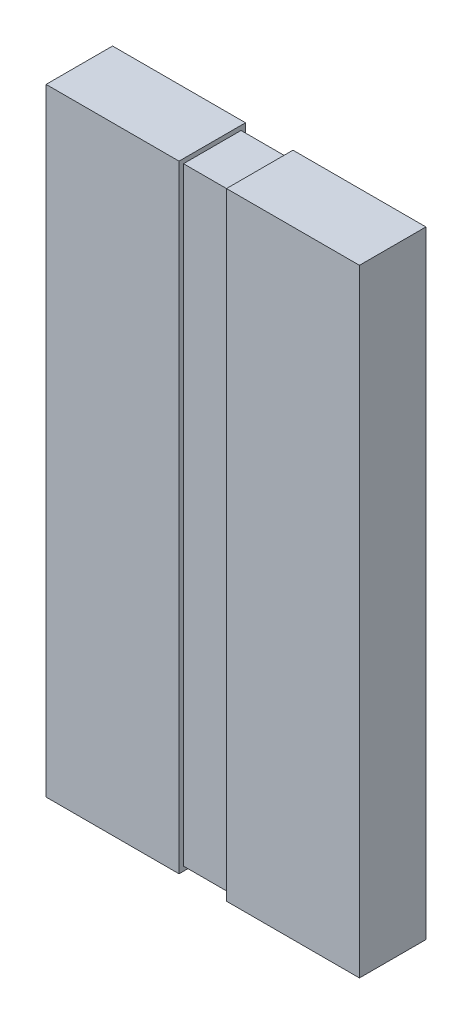
ISO-10303-21;
HEADER;
FILE_DESCRIPTION(('STEP AP214'),'2;1');
FILE_NAME('part.step','',(''),(''),'','','');
FILE_SCHEMA(('AUTOMOTIVE_DESIGN { 1 0 10303 214 1 1 1 1 }'));
ENDSEC;
DATA;
#1=APPLICATION_CONTEXT('core data for automotive mechanical design processes');
#2=APPLICATION_PROTOCOL_DEFINITION('international standard','automotive_design',2000,#1);
#3=PRODUCT_CONTEXT('',#1,'mechanical');
#4=PRODUCT('Part','Part','',(#3));
#5=PRODUCT_RELATED_PRODUCT_CATEGORY('part','',(#4));
#6=PRODUCT_DEFINITION_FORMATION('','',#4);
#7=PRODUCT_DEFINITION_CONTEXT('part definition',#1,'design');
#8=PRODUCT_DEFINITION('design','',#6,#7);
#9=PRODUCT_DEFINITION_SHAPE('','',#8);
#10=(LENGTH_UNIT() NAMED_UNIT(*) SI_UNIT(.MILLI.,.METRE.));
#11=(NAMED_UNIT(*) PLANE_ANGLE_UNIT() SI_UNIT($,.RADIAN.));
#12=(NAMED_UNIT(*) SI_UNIT($,.STERADIAN.) SOLID_ANGLE_UNIT());
#13=UNCERTAINTY_MEASURE_WITH_UNIT(LENGTH_MEASURE(1.E-05),#10,'distance_accuracy_value','');
#14=(GEOMETRIC_REPRESENTATION_CONTEXT(3) GLOBAL_UNCERTAINTY_ASSIGNED_CONTEXT((#13)) GLOBAL_UNIT_ASSIGNED_CONTEXT((#10,
#11,#12)) REPRESENTATION_CONTEXT('',''));
#15=CARTESIAN_POINT('',(0.,0.,0.));
#16=DIRECTION('',(0.,0.,1.));
#17=DIRECTION('',(1.,0.,0.));
#18=AXIS2_PLACEMENT_3D('',#15,#16,#17);
#19=CARTESIAN_POINT('',(0.25,-3.25,0.7));
#20=DIRECTION('',(0.,0.,1.));
#21=DIRECTION('',(1.,0.,0.));
#22=AXIS2_PLACEMENT_3D('',#19,#20,#21);
#23=PLANE('',#22);
#24=DIRECTION('',(1.,0.,0.));
#25=VECTOR('',#24,1.);
#26=CARTESIAN_POINT('',(1.65,3.25,0.7));
#27=LINE('',#26,#25);
#28=CARTESIAN_POINT('',(0.25,3.25,0.7));
#29=VERTEX_POINT('',#28);
#30=CARTESIAN_POINT('',(1.65,3.25,0.7));
#31=VERTEX_POINT('',#30);
#32=EDGE_CURVE('P0_E20',#29,#31,#27,.T.);
#33=ORIENTED_EDGE('',*,*,#32,.F.);
#34=DIRECTION('',(0.,1.,0.));
#35=VECTOR('',#34,1.);
#36=CARTESIAN_POINT('',(0.25,3.25,0.7));
#37=LINE('',#36,#35);
#38=CARTESIAN_POINT('',(0.25,-3.25,0.7));
#39=VERTEX_POINT('',#38);
#40=EDGE_CURVE('P0_E80',#39,#29,#37,.T.);
#41=ORIENTED_EDGE('',*,*,#40,.F.);
#42=DIRECTION('',(1.,0.,0.));
#43=VECTOR('',#42,1.);
#44=CARTESIAN_POINT('',(0.25,-3.25,0.7));
#45=LINE('',#44,#43);
#46=CARTESIAN_POINT('',(1.65,-3.25,0.7));
#47=VERTEX_POINT('',#46);
#48=EDGE_CURVE('P0_E68',#47,#39,#45,.F.);
#49=ORIENTED_EDGE('',*,*,#48,.F.);
#50=DIRECTION('',(0.,1.,0.));
#51=VECTOR('',#50,1.);
#52=CARTESIAN_POINT('',(1.65,-3.25,0.7));
#53=LINE('',#52,#51);
#54=EDGE_CURVE('P0_E55',#31,#47,#53,.F.);
#55=ORIENTED_EDGE('',*,*,#54,.F.);
#56=EDGE_LOOP('',(#33,#41,#49,#55));
#57=FACE_BOUND('',#56,.T.);
#58=ADVANCED_FACE('P0_F17',(#57),#23,.T.);
#59=CARTESIAN_POINT('',(1.65,3.25,0.));
#60=DIRECTION('',(0.,1.,0.));
#61=DIRECTION('',(0.,0.,1.));
#62=AXIS2_PLACEMENT_3D('',#59,#60,#61);
#63=PLANE('',#62);
#64=ORIENTED_EDGE('',*,*,#32,.T.);
#65=DIRECTION('',(0.,0.,-1.));
#66=VECTOR('',#65,1.);
#67=CARTESIAN_POINT('',(1.65,3.25,0.));
#68=LINE('',#67,#66);
#69=CARTESIAN_POINT('',(1.65,3.25,0.));
#70=VERTEX_POINT('',#69);
#71=EDGE_CURVE('P0_E61',#70,#31,#68,.F.);
#72=ORIENTED_EDGE('',*,*,#71,.F.);
#73=DIRECTION('',(-1.,0.,0.));
#74=VECTOR('',#73,1.);
#75=CARTESIAN_POINT('',(0.25,3.25,0.));
#76=LINE('',#75,#74);
#77=CARTESIAN_POINT('',(0.25,3.25,0.));
#78=VERTEX_POINT('',#77);
#79=EDGE_CURVE('P0_E83',#78,#70,#76,.F.);
#80=ORIENTED_EDGE('',*,*,#79,.F.);
#81=DIRECTION('',(0.,0.,1.));
#82=VECTOR('',#81,1.);
#83=CARTESIAN_POINT('',(0.25,3.25,0.));
#84=LINE('',#83,#82);
#85=EDGE_CURVE('P0_E64',#29,#78,#84,.F.);
#86=ORIENTED_EDGE('',*,*,#85,.F.);
#87=EDGE_LOOP('',(#64,#72,#80,#86));
#88=FACE_BOUND('',#87,.T.);
#89=ADVANCED_FACE('P0_F60',(#88),#63,.T.);
#90=CARTESIAN_POINT('',(1.65,-3.25,0.));
#91=DIRECTION('',(1.,0.,0.));
#92=DIRECTION('',(0.,0.,-1.));
#93=AXIS2_PLACEMENT_3D('',#90,#91,#92);
#94=PLANE('',#93);
#95=ORIENTED_EDGE('',*,*,#54,.T.);
#96=DIRECTION('',(0.,0.,-1.));
#97=VECTOR('',#96,1.);
#98=CARTESIAN_POINT('',(1.65,-3.25,0.));
#99=LINE('',#98,#97);
#100=CARTESIAN_POINT('',(1.65,-3.25,0.));
#101=VERTEX_POINT('',#100);
#102=EDGE_CURVE('P0_E70',#101,#47,#99,.F.);
#103=ORIENTED_EDGE('',*,*,#102,.F.);
#104=DIRECTION('',(0.,1.,0.));
#105=VECTOR('',#104,1.);
#106=CARTESIAN_POINT('',(1.65,3.25,0.));
#107=LINE('',#106,#105);
#108=EDGE_CURVE('P0_E74',#70,#101,#107,.F.);
#109=ORIENTED_EDGE('',*,*,#108,.F.);
#110=ORIENTED_EDGE('',*,*,#71,.T.);
#111=EDGE_LOOP('',(#95,#103,#109,#110));
#112=FACE_BOUND('',#111,.T.);
#113=ADVANCED_FACE('P0_F72',(#112),#94,.T.);
#114=CARTESIAN_POINT('',(0.25,-3.25,0.));
#115=DIRECTION('',(0.,-1.,0.));
#116=DIRECTION('',(0.,0.,-1.));
#117=AXIS2_PLACEMENT_3D('',#114,#115,#116);
#118=PLANE('',#117);
#119=ORIENTED_EDGE('',*,*,#48,.T.);
#120=DIRECTION('',(0.,0.,1.));
#121=VECTOR('',#120,1.);
#122=CARTESIAN_POINT('',(0.25,-3.25,0.));
#123=LINE('',#122,#121);
#124=CARTESIAN_POINT('',(0.25,-3.25,0.));
#125=VERTEX_POINT('',#124);
#126=EDGE_CURVE('P0_E35',#125,#39,#123,.T.);
#127=ORIENTED_EDGE('',*,*,#126,.F.);
#128=DIRECTION('',(-1.,0.,0.));
#129=VECTOR('',#128,1.);
#130=CARTESIAN_POINT('',(0.25,-3.25,0.));
#131=LINE('',#130,#129);
#132=EDGE_CURVE('P0_E26',#101,#125,#131,.T.);
#133=ORIENTED_EDGE('',*,*,#132,.F.);
#134=ORIENTED_EDGE('',*,*,#102,.T.);
#135=EDGE_LOOP('',(#119,#127,#133,#134));
#136=FACE_BOUND('',#135,.T.);
#137=ADVANCED_FACE('P0_F89',(#136),#118,.T.);
#138=CARTESIAN_POINT('',(0.25,3.25,0.));
#139=DIRECTION('',(-1.,0.,0.));
#140=DIRECTION('',(0.,0.,1.));
#141=AXIS2_PLACEMENT_3D('',#138,#139,#140);
#142=PLANE('',#141);
#143=ORIENTED_EDGE('',*,*,#40,.T.);
#144=ORIENTED_EDGE('',*,*,#85,.T.);
#145=DIRECTION('',(0.,1.,0.));
#146=VECTOR('',#145,1.);
#147=CARTESIAN_POINT('',(0.25,3.25,0.));
#148=LINE('',#147,#146);
#149=EDGE_CURVE('P0_E11',#125,#78,#148,.T.);
#150=ORIENTED_EDGE('',*,*,#149,.F.);
#151=ORIENTED_EDGE('',*,*,#126,.T.);
#152=EDGE_LOOP('',(#143,#144,#150,#151));
#153=FACE_BOUND('',#152,.T.);
#154=ADVANCED_FACE('P0_F91',(#153),#142,.T.);
#155=CARTESIAN_POINT('',(0.25,3.25,0.));
#156=DIRECTION('',(0.,0.,-1.));
#157=DIRECTION('',(-1.,0.,0.));
#158=AXIS2_PLACEMENT_3D('',#155,#156,#157);
#159=PLANE('',#158);
#160=ORIENTED_EDGE('',*,*,#132,.T.);
#161=ORIENTED_EDGE('',*,*,#149,.T.);
#162=ORIENTED_EDGE('',*,*,#79,.T.);
#163=ORIENTED_EDGE('',*,*,#108,.T.);
#164=EDGE_LOOP('',(#160,#161,#162,#163));
#165=FACE_BOUND('',#164,.T.);
#166=ADVANCED_FACE('P0_F88',(#165),#159,.T.);
#167=CLOSED_SHELL('',(#58,#89,#113,#137,#154,#166));
#168=MANIFOLD_SOLID_BREP('P0_B1',#167);
#169=CARTESIAN_POINT('',(-0.25,3.203,0.047));
#170=DIRECTION('',(-1.,0.,0.));
#171=DIRECTION('',(0.,0.,1.));
#172=AXIS2_PLACEMENT_3D('',#169,#170,#171);
#173=PLANE('',#172);
#174=DIRECTION('',(0.,1.,0.));
#175=VECTOR('',#174,1.);
#176=CARTESIAN_POINT('',(-0.25,-3.203,0.653));
#177=LINE('',#176,#175);
#178=CARTESIAN_POINT('',(-0.25,3.203,0.653));
#179=VERTEX_POINT('',#178);
#180=CARTESIAN_POINT('',(-0.25,-3.203,0.653));
#181=VERTEX_POINT('',#180);
#182=EDGE_CURVE('P1_E70',#179,#181,#177,.F.);
#183=ORIENTED_EDGE('',*,*,#182,.F.);
#184=DIRECTION('',(0.,0.,1.));
#185=VECTOR('',#184,1.);
#186=CARTESIAN_POINT('',(-0.25,3.203,0.047));
#187=LINE('',#186,#185);
#188=CARTESIAN_POINT('',(-0.25,3.203,0.047));
#189=VERTEX_POINT('',#188);
#190=EDGE_CURVE('P1_E56',#189,#179,#187,.T.);
#191=ORIENTED_EDGE('',*,*,#190,.F.);
#192=DIRECTION('',(0.,1.,0.));
#193=VECTOR('',#192,1.);
#194=CARTESIAN_POINT('',(-0.25,3.203,0.047));
#195=LINE('',#194,#193);
#196=CARTESIAN_POINT('',(-0.25,-3.203,0.047));
#197=VERTEX_POINT('',#196);
#198=EDGE_CURVE('P1_E62',#197,#189,#195,.T.);
#199=ORIENTED_EDGE('',*,*,#198,.F.);
#200=DIRECTION('',(0.,0.,1.));
#201=VECTOR('',#200,1.);
#202=CARTESIAN_POINT('',(-0.25,-3.203,0.047));
#203=LINE('',#202,#201);
#204=EDGE_CURVE('P1_E20',#197,#181,#203,.T.);
#205=ORIENTED_EDGE('',*,*,#204,.T.);
#206=EDGE_LOOP('',(#183,#191,#199,#205));
#207=FACE_BOUND('',#206,.T.);
#208=ADVANCED_FACE('P1_F17',(#207),#173,.T.);
#209=CARTESIAN_POINT('',(-0.25,3.203,0.047));
#210=DIRECTION('',(0.,0.,-1.));
#211=DIRECTION('',(-1.,0.,0.));
#212=AXIS2_PLACEMENT_3D('',#209,#210,#211);
#213=PLANE('',#212);
#214=DIRECTION('',(1.,0.,0.));
#215=VECTOR('',#214,1.);
#216=CARTESIAN_POINT('',(-0.25,-3.203,0.047));
#217=LINE('',#216,#215);
#218=CARTESIAN_POINT('',(0.25,-3.203,0.047));
#219=VERTEX_POINT('',#218);
#220=EDGE_CURVE('P1_E67',#197,#219,#217,.T.);
#221=ORIENTED_EDGE('',*,*,#220,.F.);
#222=ORIENTED_EDGE('',*,*,#198,.T.);
#223=DIRECTION('',(1.,0.,0.));
#224=VECTOR('',#223,1.);
#225=CARTESIAN_POINT('',(0.25,3.203,0.047));
#226=LINE('',#225,#224);
#227=CARTESIAN_POINT('',(0.25,3.203,0.047));
#228=VERTEX_POINT('',#227);
#229=EDGE_CURVE('P1_E64',#228,#189,#226,.F.);
#230=ORIENTED_EDGE('',*,*,#229,.F.);
#231=DIRECTION('',(0.,1.,0.));
#232=VECTOR('',#231,1.);
#233=CARTESIAN_POINT('',(0.25,-3.203,0.047));
#234=LINE('',#233,#232);
#235=EDGE_CURVE('P1_E85',#219,#228,#234,.T.);
#236=ORIENTED_EDGE('',*,*,#235,.F.);
#237=EDGE_LOOP('',(#221,#222,#230,#236));
#238=FACE_BOUND('',#237,.T.);
#239=ADVANCED_FACE('P1_F63',(#238),#213,.T.);
#240=CARTESIAN_POINT('',(0.25,3.203,0.047));
#241=DIRECTION('',(0.,1.,0.));
#242=DIRECTION('',(0.,0.,1.));
#243=AXIS2_PLACEMENT_3D('',#240,#241,#242);
#244=PLANE('',#243);
#245=DIRECTION('',(1.,0.,0.));
#246=VECTOR('',#245,1.);
#247=CARTESIAN_POINT('',(-0.25,3.203,0.653));
#248=LINE('',#247,#246);
#249=CARTESIAN_POINT('',(0.25,3.203,0.653));
#250=VERTEX_POINT('',#249);
#251=EDGE_CURVE('P1_E72',#250,#179,#248,.F.);
#252=ORIENTED_EDGE('',*,*,#251,.F.);
#253=DIRECTION('',(0.,0.,-1.));
#254=VECTOR('',#253,1.);
#255=CARTESIAN_POINT('',(0.25,3.203,0.047));
#256=LINE('',#255,#254);
#257=EDGE_CURVE('P1_E76',#228,#250,#256,.F.);
#258=ORIENTED_EDGE('',*,*,#257,.F.);
#259=ORIENTED_EDGE('',*,*,#229,.T.);
#260=ORIENTED_EDGE('',*,*,#190,.T.);
#261=EDGE_LOOP('',(#252,#258,#259,#260));
#262=FACE_BOUND('',#261,.T.);
#263=ADVANCED_FACE('P1_F74',(#262),#244,.T.);
#264=CARTESIAN_POINT('',(-0.25,-3.203,0.653));
#265=DIRECTION('',(0.,0.,1.));
#266=DIRECTION('',(1.,0.,0.));
#267=AXIS2_PLACEMENT_3D('',#264,#265,#266);
#268=PLANE('',#267);
#269=ORIENTED_EDGE('',*,*,#251,.T.);
#270=ORIENTED_EDGE('',*,*,#182,.T.);
#271=DIRECTION('',(1.,0.,0.));
#272=VECTOR('',#271,1.);
#273=CARTESIAN_POINT('',(-0.25,-3.203,0.653));
#274=LINE('',#273,#272);
#275=CARTESIAN_POINT('',(0.25,-3.203,0.653));
#276=VERTEX_POINT('',#275);
#277=EDGE_CURVE('P1_E35',#276,#181,#274,.F.);
#278=ORIENTED_EDGE('',*,*,#277,.F.);
#279=DIRECTION('',(0.,1.,0.));
#280=VECTOR('',#279,1.);
#281=CARTESIAN_POINT('',(0.25,-3.203,0.653));
#282=LINE('',#281,#280);
#283=EDGE_CURVE('P1_E26',#250,#276,#282,.F.);
#284=ORIENTED_EDGE('',*,*,#283,.F.);
#285=EDGE_LOOP('',(#269,#270,#278,#284));
#286=FACE_BOUND('',#285,.T.);
#287=ADVANCED_FACE('P1_F91',(#286),#268,.T.);
#288=CARTESIAN_POINT('',(-0.25,-3.203,0.047));
#289=DIRECTION('',(0.,-1.,0.));
#290=DIRECTION('',(0.,0.,-1.));
#291=AXIS2_PLACEMENT_3D('',#288,#289,#290);
#292=PLANE('',#291);
#293=ORIENTED_EDGE('',*,*,#277,.T.);
#294=ORIENTED_EDGE('',*,*,#204,.F.);
#295=ORIENTED_EDGE('',*,*,#220,.T.);
#296=DIRECTION('',(0.,0.,-1.));
#297=VECTOR('',#296,1.);
#298=CARTESIAN_POINT('',(0.25,-3.203,0.047));
#299=LINE('',#298,#297);
#300=EDGE_CURVE('P1_E11',#276,#219,#299,.T.);
#301=ORIENTED_EDGE('',*,*,#300,.F.);
#302=EDGE_LOOP('',(#293,#294,#295,#301));
#303=FACE_BOUND('',#302,.T.);
#304=ADVANCED_FACE('P1_F93',(#303),#292,.T.);
#305=CARTESIAN_POINT('',(0.25,-3.203,0.047));
#306=DIRECTION('',(1.,0.,0.));
#307=DIRECTION('',(0.,0.,-1.));
#308=AXIS2_PLACEMENT_3D('',#305,#306,#307);
#309=PLANE('',#308);
#310=ORIENTED_EDGE('',*,*,#283,.T.);
#311=ORIENTED_EDGE('',*,*,#300,.T.);
#312=ORIENTED_EDGE('',*,*,#235,.T.);
#313=ORIENTED_EDGE('',*,*,#257,.T.);
#314=EDGE_LOOP('',(#310,#311,#312,#313));
#315=FACE_BOUND('',#314,.T.);
#316=ADVANCED_FACE('P1_F90',(#315),#309,.T.);
#317=CLOSED_SHELL('',(#208,#239,#263,#287,#304,#316));
#318=MANIFOLD_SOLID_BREP('P1_B1',#317);
#319=CARTESIAN_POINT('',(-1.65,-3.25,0.7));
#320=DIRECTION('',(0.,0.,1.));
#321=DIRECTION('',(1.,0.,0.));
#322=AXIS2_PLACEMENT_3D('',#319,#320,#321);
#323=PLANE('',#322);
#324=DIRECTION('',(1.,0.,0.));
#325=VECTOR('',#324,1.);
#326=CARTESIAN_POINT('',(-0.25,3.25,0.7));
#327=LINE('',#326,#325);
#328=CARTESIAN_POINT('',(-1.65,3.25,0.7));
#329=VERTEX_POINT('',#328);
#330=CARTESIAN_POINT('',(-0.25,3.25,0.7));
#331=VERTEX_POINT('',#330);
#332=EDGE_CURVE('P2_E19',#329,#331,#327,.T.);
#333=ORIENTED_EDGE('',*,*,#332,.F.);
#334=DIRECTION('',(0.,1.,0.));
#335=VECTOR('',#334,1.);
#336=CARTESIAN_POINT('',(-1.65,3.25,0.7));
#337=LINE('',#336,#335);
#338=CARTESIAN_POINT('',(-1.65,-3.25,0.7));
#339=VERTEX_POINT('',#338);
#340=EDGE_CURVE('P2_E80',#339,#329,#337,.T.);
#341=ORIENTED_EDGE('',*,*,#340,.F.);
#342=DIRECTION('',(1.,0.,0.));
#343=VECTOR('',#342,1.);
#344=CARTESIAN_POINT('',(-1.65,-3.25,0.7));
#345=LINE('',#344,#343);
#346=CARTESIAN_POINT('',(-0.25,-3.25,0.7));
#347=VERTEX_POINT('',#346);
#348=EDGE_CURVE('P2_E67',#347,#339,#345,.F.);
#349=ORIENTED_EDGE('',*,*,#348,.F.);
#350=DIRECTION('',(0.,1.,0.));
#351=VECTOR('',#350,1.);
#352=CARTESIAN_POINT('',(-0.25,-3.25,0.7));
#353=LINE('',#352,#351);
#354=EDGE_CURVE('P2_E54',#331,#347,#353,.F.);
#355=ORIENTED_EDGE('',*,*,#354,.F.);
#356=EDGE_LOOP('',(#333,#341,#349,#355));
#357=FACE_BOUND('',#356,.T.);
#358=ADVANCED_FACE('P2_F16',(#357),#323,.T.);
#359=CARTESIAN_POINT('',(-0.25,3.25,0.));
#360=DIRECTION('',(0.,1.,0.));
#361=DIRECTION('',(0.,0.,1.));
#362=AXIS2_PLACEMENT_3D('',#359,#360,#361);
#363=PLANE('',#362);
#364=ORIENTED_EDGE('',*,*,#332,.T.);
#365=DIRECTION('',(0.,0.,-1.));
#366=VECTOR('',#365,1.);
#367=CARTESIAN_POINT('',(-0.25,3.25,0.));
#368=LINE('',#367,#366);
#369=CARTESIAN_POINT('',(-0.25,3.25,0.));
#370=VERTEX_POINT('',#369);
#371=EDGE_CURVE('P2_E60',#370,#331,#368,.F.);
#372=ORIENTED_EDGE('',*,*,#371,.F.);
#373=DIRECTION('',(-1.,0.,0.));
#374=VECTOR('',#373,1.);
#375=CARTESIAN_POINT('',(-1.65,3.25,0.));
#376=LINE('',#375,#374);
#377=CARTESIAN_POINT('',(-1.65,3.25,0.));
#378=VERTEX_POINT('',#377);
#379=EDGE_CURVE('P2_E83',#378,#370,#376,.F.);
#380=ORIENTED_EDGE('',*,*,#379,.F.);
#381=DIRECTION('',(0.,0.,1.));
#382=VECTOR('',#381,1.);
#383=CARTESIAN_POINT('',(-1.65,3.25,0.));
#384=LINE('',#383,#382);
#385=EDGE_CURVE('P2_E63',#329,#378,#384,.F.);
#386=ORIENTED_EDGE('',*,*,#385,.F.);
#387=EDGE_LOOP('',(#364,#372,#380,#386));
#388=FACE_BOUND('',#387,.T.);
#389=ADVANCED_FACE('P2_F59',(#388),#363,.T.);
#390=CARTESIAN_POINT('',(-0.25,-3.25,0.));
#391=DIRECTION('',(1.,0.,0.));
#392=DIRECTION('',(0.,0.,-1.));
#393=AXIS2_PLACEMENT_3D('',#390,#391,#392);
#394=PLANE('',#393);
#395=ORIENTED_EDGE('',*,*,#354,.T.);
#396=DIRECTION('',(0.,0.,-1.));
#397=VECTOR('',#396,1.);
#398=CARTESIAN_POINT('',(-0.25,-3.25,0.));
#399=LINE('',#398,#397);
#400=CARTESIAN_POINT('',(-0.25,-3.25,0.));
#401=VERTEX_POINT('',#400);
#402=EDGE_CURVE('P2_E70',#401,#347,#399,.F.);
#403=ORIENTED_EDGE('',*,*,#402,.F.);
#404=DIRECTION('',(0.,1.,0.));
#405=VECTOR('',#404,1.);
#406=CARTESIAN_POINT('',(-0.25,3.25,0.));
#407=LINE('',#406,#405);
#408=EDGE_CURVE('P2_E74',#370,#401,#407,.F.);
#409=ORIENTED_EDGE('',*,*,#408,.F.);
#410=ORIENTED_EDGE('',*,*,#371,.T.);
#411=EDGE_LOOP('',(#395,#403,#409,#410));
#412=FACE_BOUND('',#411,.T.);
#413=ADVANCED_FACE('P2_F72',(#412),#394,.T.);
#414=CARTESIAN_POINT('',(-1.65,-3.25,0.));
#415=DIRECTION('',(0.,-1.,0.));
#416=DIRECTION('',(0.,0.,-1.));
#417=AXIS2_PLACEMENT_3D('',#414,#415,#416);
#418=PLANE('',#417);
#419=ORIENTED_EDGE('',*,*,#348,.T.);
#420=DIRECTION('',(0.,0.,1.));
#421=VECTOR('',#420,1.);
#422=CARTESIAN_POINT('',(-1.65,-3.25,0.));
#423=LINE('',#422,#421);
#424=CARTESIAN_POINT('',(-1.65,-3.25,0.));
#425=VERTEX_POINT('',#424);
#426=EDGE_CURVE('P2_E34',#425,#339,#423,.T.);
#427=ORIENTED_EDGE('',*,*,#426,.F.);
#428=DIRECTION('',(-1.,0.,0.));
#429=VECTOR('',#428,1.);
#430=CARTESIAN_POINT('',(-1.65,-3.25,0.));
#431=LINE('',#430,#429);
#432=EDGE_CURVE('P2_E25',#401,#425,#431,.T.);
#433=ORIENTED_EDGE('',*,*,#432,.F.);
#434=ORIENTED_EDGE('',*,*,#402,.T.);
#435=EDGE_LOOP('',(#419,#427,#433,#434));
#436=FACE_BOUND('',#435,.T.);
#437=ADVANCED_FACE('P2_F90',(#436),#418,.T.);
#438=CARTESIAN_POINT('',(-1.65,3.25,0.));
#439=DIRECTION('',(-1.,0.,0.));
#440=DIRECTION('',(0.,0.,1.));
#441=AXIS2_PLACEMENT_3D('',#438,#439,#440);
#442=PLANE('',#441);
#443=ORIENTED_EDGE('',*,*,#340,.T.);
#444=ORIENTED_EDGE('',*,*,#385,.T.);
#445=DIRECTION('',(0.,1.,0.));
#446=VECTOR('',#445,1.);
#447=CARTESIAN_POINT('',(-1.65,3.25,0.));
#448=LINE('',#447,#446);
#449=EDGE_CURVE('P2_E10',#425,#378,#448,.T.);
#450=ORIENTED_EDGE('',*,*,#449,.F.);
#451=ORIENTED_EDGE('',*,*,#426,.T.);
#452=EDGE_LOOP('',(#443,#444,#450,#451));
#453=FACE_BOUND('',#452,.T.);
#454=ADVANCED_FACE('P2_F92',(#453),#442,.T.);
#455=CARTESIAN_POINT('',(-1.65,3.25,0.));
#456=DIRECTION('',(0.,0.,-1.));
#457=DIRECTION('',(-1.,0.,0.));
#458=AXIS2_PLACEMENT_3D('',#455,#456,#457);
#459=PLANE('',#458);
#460=ORIENTED_EDGE('',*,*,#432,.T.);
#461=ORIENTED_EDGE('',*,*,#449,.T.);
#462=ORIENTED_EDGE('',*,*,#379,.T.);
#463=ORIENTED_EDGE('',*,*,#408,.T.);
#464=EDGE_LOOP('',(#460,#461,#462,#463));
#465=FACE_BOUND('',#464,.T.);
#466=ADVANCED_FACE('P2_F89',(#465),#459,.T.);
#467=CLOSED_SHELL('',(#358,#389,#413,#437,#454,#466));
#468=MANIFOLD_SOLID_BREP('P2_B1',#467);
#469=ADVANCED_BREP_SHAPE_REPRESENTATION('',(#18,#168,#318,#468),#14);
#470=SHAPE_DEFINITION_REPRESENTATION(#9,#469);
ENDSEC;
END-ISO-10303-21;
